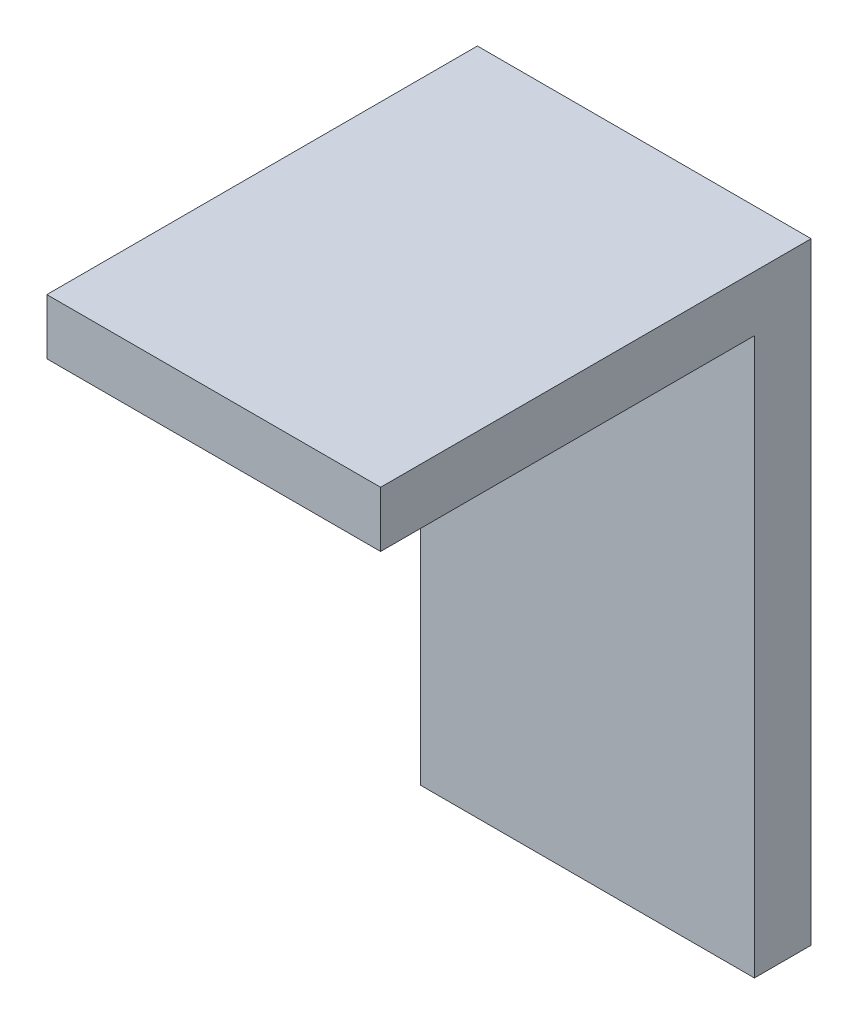
ISO-10303-21;
HEADER;
FILE_DESCRIPTION(('STEP AP214'),'2;1');
FILE_NAME('part.step','',(''),(''),'','','');
FILE_SCHEMA(('AUTOMOTIVE_DESIGN { 1 0 10303 214 1 1 1 1 }'));
ENDSEC;
DATA;
#1=APPLICATION_CONTEXT('core data for automotive mechanical design processes');
#2=APPLICATION_PROTOCOL_DEFINITION('international standard','automotive_design',2000,#1);
#3=PRODUCT_CONTEXT('',#1,'mechanical');
#4=PRODUCT('Part','Part','',(#3));
#5=PRODUCT_RELATED_PRODUCT_CATEGORY('part','',(#4));
#6=PRODUCT_DEFINITION_FORMATION('','',#4);
#7=PRODUCT_DEFINITION_CONTEXT('part definition',#1,'design');
#8=PRODUCT_DEFINITION('design','',#6,#7);
#9=PRODUCT_DEFINITION_SHAPE('','',#8);
#10=(LENGTH_UNIT() NAMED_UNIT(*) SI_UNIT(.MILLI.,.METRE.));
#11=(NAMED_UNIT(*) PLANE_ANGLE_UNIT() SI_UNIT($,.RADIAN.));
#12=(NAMED_UNIT(*) SI_UNIT($,.STERADIAN.) SOLID_ANGLE_UNIT());
#13=UNCERTAINTY_MEASURE_WITH_UNIT(LENGTH_MEASURE(1.E-05),#10,'distance_accuracy_value','');
#14=(GEOMETRIC_REPRESENTATION_CONTEXT(3) GLOBAL_UNCERTAINTY_ASSIGNED_CONTEXT((#13)) GLOBAL_UNIT_ASSIGNED_CONTEXT((#10,
#11,#12)) REPRESENTATION_CONTEXT('',''));
#15=CARTESIAN_POINT('',(0.,0.,0.));
#16=DIRECTION('',(0.,0.,1.));
#17=DIRECTION('',(1.,0.,0.));
#18=AXIS2_PLACEMENT_3D('',#15,#16,#17);
#19=CARTESIAN_POINT('',(-1.4,4.55,0.));
#20=DIRECTION('',(-1.,0.,0.));
#21=DIRECTION('',(0.,0.,1.));
#22=AXIS2_PLACEMENT_3D('',#19,#20,#21);
#23=PLANE('',#22);
#24=DIRECTION('',(0.,1.,0.));
#25=VECTOR('',#24,1.);
#26=CARTESIAN_POINT('',(-1.4,4.,0.));
#27=LINE('',#26,#25);
#28=CARTESIAN_POINT('',(-1.4,4.,0.));
#29=VERTEX_POINT('',#28);
#30=CARTESIAN_POINT('',(-1.4,4.55,0.));
#31=VERTEX_POINT('',#30);
#32=EDGE_CURVE('E11',#29,#31,#27,.T.);
#33=ORIENTED_EDGE('',*,*,#32,.F.);
#34=DIRECTION('',(0.,0.,-1.));
#35=VECTOR('',#34,1.);
#36=CARTESIAN_POINT('',(-1.4,4.,0.051));
#37=LINE('',#36,#35);
#38=CARTESIAN_POINT('',(-1.4,4.,0.051));
#39=VERTEX_POINT('',#38);
#40=EDGE_CURVE('E24',#39,#29,#37,.T.);
#41=ORIENTED_EDGE('',*,*,#40,.F.);
#42=DIRECTION('',(0.,-1.,0.));
#43=VECTOR('',#42,1.);
#44=CARTESIAN_POINT('',(-1.4,4.5,0.051));
#45=LINE('',#44,#43);
#46=CARTESIAN_POINT('',(-1.4,4.5,0.051));
#47=VERTEX_POINT('',#46);
#48=EDGE_CURVE('E87',#47,#39,#45,.T.);
#49=ORIENTED_EDGE('',*,*,#48,.F.);
#50=DIRECTION('',(0.,0.,-1.));
#51=VECTOR('',#50,1.);
#52=CARTESIAN_POINT('',(-1.4,4.5,0.387));
#53=LINE('',#52,#51);
#54=CARTESIAN_POINT('',(-1.4,4.5,0.387));
#55=VERTEX_POINT('',#54);
#56=EDGE_CURVE('E114',#55,#47,#53,.T.);
#57=ORIENTED_EDGE('',*,*,#56,.F.);
#58=DIRECTION('',(0.,-1.,0.));
#59=VECTOR('',#58,1.);
#60=CARTESIAN_POINT('',(-1.4,4.55,0.387));
#61=LINE('',#60,#59);
#62=CARTESIAN_POINT('',(-1.4,4.55,0.387));
#63=VERTEX_POINT('',#62);
#64=EDGE_CURVE('E111',#63,#55,#61,.T.);
#65=ORIENTED_EDGE('',*,*,#64,.F.);
#66=DIRECTION('',(0.,0.,1.));
#67=VECTOR('',#66,1.);
#68=CARTESIAN_POINT('',(-1.4,4.55,0.));
#69=LINE('',#68,#67);
#70=EDGE_CURVE('E108',#31,#63,#69,.T.);
#71=ORIENTED_EDGE('',*,*,#70,.F.);
#72=EDGE_LOOP('',(#33,#41,#49,#57,#65,#71));
#73=FACE_BOUND('',#72,.T.);
#74=ADVANCED_FACE('F17',(#73),#23,.T.);
#75=CARTESIAN_POINT('',(-1.1,4.,0.));
#76=DIRECTION('',(1.,0.,0.));
#77=DIRECTION('',(0.,0.,1.));
#78=AXIS2_PLACEMENT_3D('',#75,#76,#77);
#79=PLANE('',#78);
#80=DIRECTION('',(0.,-1.,0.));
#81=VECTOR('',#80,1.);
#82=CARTESIAN_POINT('',(-1.1,4.55,0.));
#83=LINE('',#82,#81);
#84=CARTESIAN_POINT('',(-1.1,4.55,0.));
#85=VERTEX_POINT('',#84);
#86=CARTESIAN_POINT('',(-1.1,4.,0.));
#87=VERTEX_POINT('',#86);
#88=EDGE_CURVE('E106',#85,#87,#83,.T.);
#89=ORIENTED_EDGE('',*,*,#88,.F.);
#90=DIRECTION('',(0.,0.,-1.));
#91=VECTOR('',#90,1.);
#92=CARTESIAN_POINT('',(-1.1,4.55,0.387));
#93=LINE('',#92,#91);
#94=CARTESIAN_POINT('',(-1.1,4.55,0.387));
#95=VERTEX_POINT('',#94);
#96=EDGE_CURVE('E103',#95,#85,#93,.T.);
#97=ORIENTED_EDGE('',*,*,#96,.F.);
#98=DIRECTION('',(0.,1.,0.));
#99=VECTOR('',#98,1.);
#100=CARTESIAN_POINT('',(-1.1,4.5,0.387));
#101=LINE('',#100,#99);
#102=CARTESIAN_POINT('',(-1.1,4.5,0.387));
#103=VERTEX_POINT('',#102);
#104=EDGE_CURVE('E100',#103,#95,#101,.T.);
#105=ORIENTED_EDGE('',*,*,#104,.F.);
#106=DIRECTION('',(0.,0.,1.));
#107=VECTOR('',#106,1.);
#108=CARTESIAN_POINT('',(-1.1,4.5,0.051));
#109=LINE('',#108,#107);
#110=CARTESIAN_POINT('',(-1.1,4.5,0.051));
#111=VERTEX_POINT('',#110);
#112=EDGE_CURVE('E72',#111,#103,#109,.T.);
#113=ORIENTED_EDGE('',*,*,#112,.F.);
#114=DIRECTION('',(0.,1.,0.));
#115=VECTOR('',#114,1.);
#116=CARTESIAN_POINT('',(-1.1,4.,0.051));
#117=LINE('',#116,#115);
#118=CARTESIAN_POINT('',(-1.1,4.,0.051));
#119=VERTEX_POINT('',#118);
#120=EDGE_CURVE('E66',#119,#111,#117,.T.);
#121=ORIENTED_EDGE('',*,*,#120,.F.);
#122=DIRECTION('',(0.,0.,1.));
#123=VECTOR('',#122,1.);
#124=CARTESIAN_POINT('',(-1.1,4.,0.));
#125=LINE('',#124,#123);
#126=EDGE_CURVE('E69',#87,#119,#125,.T.);
#127=ORIENTED_EDGE('',*,*,#126,.F.);
#128=EDGE_LOOP('',(#89,#97,#105,#113,#121,#127));
#129=FACE_BOUND('',#128,.T.);
#130=ADVANCED_FACE('F68',(#129),#79,.T.);
#131=CARTESIAN_POINT('',(-1.4,4.55,0.387));
#132=DIRECTION('',(0.,0.,1.));
#133=DIRECTION('',(0.,1.,0.));
#134=AXIS2_PLACEMENT_3D('',#131,#132,#133);
#135=PLANE('',#134);
#136=ORIENTED_EDGE('',*,*,#64,.T.);
#137=DIRECTION('',(-1.,0.,0.));
#138=VECTOR('',#137,1.);
#139=CARTESIAN_POINT('',(-1.1,4.5,0.387));
#140=LINE('',#139,#138);
#141=EDGE_CURVE('E83',#103,#55,#140,.T.);
#142=ORIENTED_EDGE('',*,*,#141,.F.);
#143=ORIENTED_EDGE('',*,*,#104,.T.);
#144=DIRECTION('',(1.,0.,0.));
#145=VECTOR('',#144,1.);
#146=CARTESIAN_POINT('',(-1.4,4.55,0.387));
#147=LINE('',#146,#145);
#148=EDGE_CURVE('E88',#63,#95,#147,.T.);
#149=ORIENTED_EDGE('',*,*,#148,.F.);
#150=EDGE_LOOP('',(#136,#142,#143,#149));
#151=FACE_BOUND('',#150,.T.);
#152=ADVANCED_FACE('F125',(#151),#135,.T.);
#153=CARTESIAN_POINT('',(-1.4,4.5,0.051));
#154=DIRECTION('',(0.,0.,1.));
#155=DIRECTION('',(0.,1.,0.));
#156=AXIS2_PLACEMENT_3D('',#153,#154,#155);
#157=PLANE('',#156);
#158=ORIENTED_EDGE('',*,*,#48,.T.);
#159=DIRECTION('',(-1.,0.,0.));
#160=VECTOR('',#159,1.);
#161=CARTESIAN_POINT('',(-1.1,4.,0.051));
#162=LINE('',#161,#160);
#163=EDGE_CURVE('E81',#119,#39,#162,.T.);
#164=ORIENTED_EDGE('',*,*,#163,.F.);
#165=ORIENTED_EDGE('',*,*,#120,.T.);
#166=DIRECTION('',(1.,0.,0.));
#167=VECTOR('',#166,1.);
#168=CARTESIAN_POINT('',(-1.4,4.5,0.051));
#169=LINE('',#168,#167);
#170=EDGE_CURVE('E89',#47,#111,#169,.T.);
#171=ORIENTED_EDGE('',*,*,#170,.F.);
#172=EDGE_LOOP('',(#158,#164,#165,#171));
#173=FACE_BOUND('',#172,.T.);
#174=ADVANCED_FACE('F86',(#173),#157,.T.);
#175=CARTESIAN_POINT('',(-1.1,4.55,0.));
#176=DIRECTION('',(0.,1.,0.));
#177=DIRECTION('',(0.,0.,1.));
#178=AXIS2_PLACEMENT_3D('',#175,#176,#177);
#179=PLANE('',#178);
#180=DIRECTION('',(1.,0.,0.));
#181=VECTOR('',#180,1.);
#182=CARTESIAN_POINT('',(-1.4,4.55,0.));
#183=LINE('',#182,#181);
#184=EDGE_CURVE('E93',#31,#85,#183,.T.);
#185=ORIENTED_EDGE('',*,*,#184,.F.);
#186=ORIENTED_EDGE('',*,*,#70,.T.);
#187=ORIENTED_EDGE('',*,*,#148,.T.);
#188=ORIENTED_EDGE('',*,*,#96,.T.);
#189=EDGE_LOOP('',(#185,#186,#187,#188));
#190=FACE_BOUND('',#189,.T.);
#191=ADVANCED_FACE('F121',(#190),#179,.T.);
#192=CARTESIAN_POINT('',(-1.4,4.,0.));
#193=DIRECTION('',(0.,-1.,0.));
#194=DIRECTION('',(0.,0.,1.));
#195=AXIS2_PLACEMENT_3D('',#192,#193,#194);
#196=PLANE('',#195);
#197=DIRECTION('',(-1.,0.,0.));
#198=VECTOR('',#197,1.);
#199=CARTESIAN_POINT('',(-1.1,4.,0.));
#200=LINE('',#199,#198);
#201=EDGE_CURVE('E82',#87,#29,#200,.T.);
#202=ORIENTED_EDGE('',*,*,#201,.F.);
#203=ORIENTED_EDGE('',*,*,#126,.T.);
#204=ORIENTED_EDGE('',*,*,#163,.T.);
#205=ORIENTED_EDGE('',*,*,#40,.T.);
#206=EDGE_LOOP('',(#202,#203,#204,#205));
#207=FACE_BOUND('',#206,.T.);
#208=ADVANCED_FACE('F80',(#207),#196,.T.);
#209=CARTESIAN_POINT('',(-1.4,4.5,0.051));
#210=DIRECTION('',(0.,-1.,0.));
#211=DIRECTION('',(0.,0.,1.));
#212=AXIS2_PLACEMENT_3D('',#209,#210,#211);
#213=PLANE('',#212);
#214=ORIENTED_EDGE('',*,*,#170,.T.);
#215=ORIENTED_EDGE('',*,*,#112,.T.);
#216=ORIENTED_EDGE('',*,*,#141,.T.);
#217=ORIENTED_EDGE('',*,*,#56,.T.);
#218=EDGE_LOOP('',(#214,#215,#216,#217));
#219=FACE_BOUND('',#218,.T.);
#220=ADVANCED_FACE('F127',(#219),#213,.T.);
#221=CARTESIAN_POINT('',(-1.1,4.55,0.));
#222=DIRECTION('',(0.,0.,-1.));
#223=DIRECTION('',(0.,1.,0.));
#224=AXIS2_PLACEMENT_3D('',#221,#222,#223);
#225=PLANE('',#224);
#226=ORIENTED_EDGE('',*,*,#88,.T.);
#227=ORIENTED_EDGE('',*,*,#201,.T.);
#228=ORIENTED_EDGE('',*,*,#32,.T.);
#229=ORIENTED_EDGE('',*,*,#184,.T.);
#230=EDGE_LOOP('',(#226,#227,#228,#229));
#231=FACE_BOUND('',#230,.T.);
#232=ADVANCED_FACE('F117',(#231),#225,.T.);
#233=CLOSED_SHELL('',(#74,#130,#152,#174,#191,#208,#220,#232));
#234=MANIFOLD_SOLID_BREP('B1',#233);
#235=ADVANCED_BREP_SHAPE_REPRESENTATION('',(#18,#234),#14);
#236=SHAPE_DEFINITION_REPRESENTATION(#9,#235);
ENDSEC;
END-ISO-10303-21;
